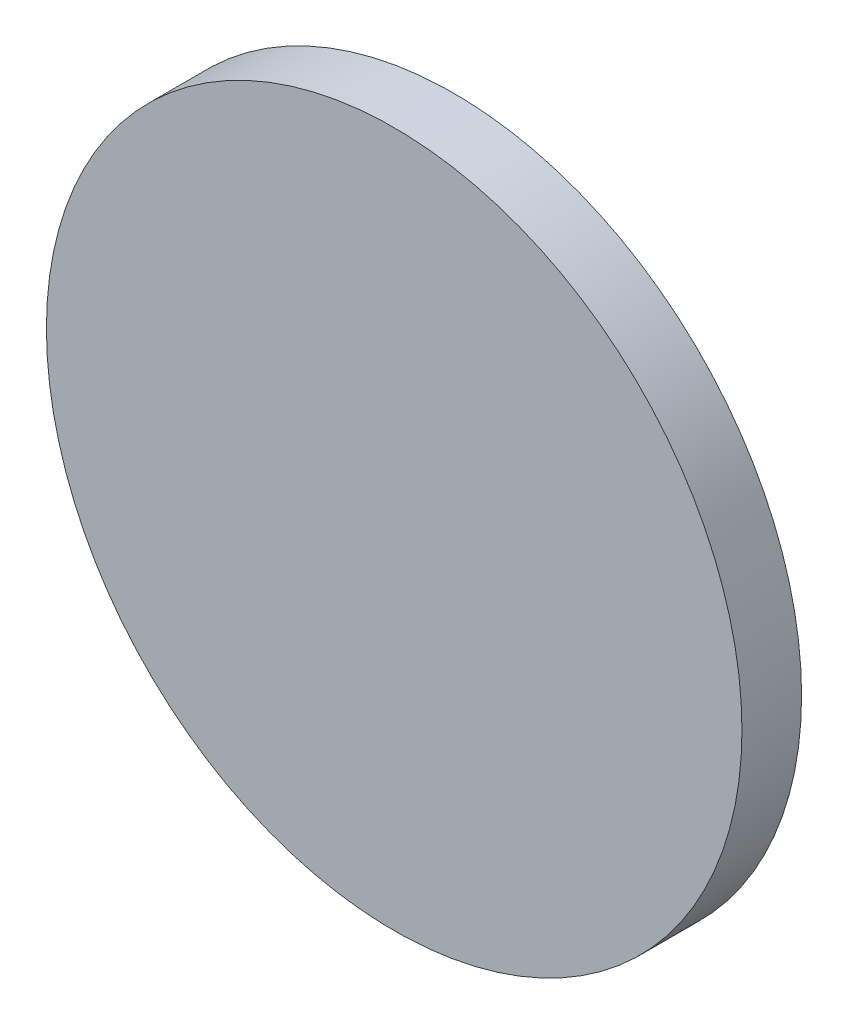
ISO-10303-21;
HEADER;
FILE_DESCRIPTION(('STEP AP214'),'2;1');
FILE_NAME('part.step','',(''),(''),'','','');
FILE_SCHEMA(('AUTOMOTIVE_DESIGN { 1 0 10303 214 1 1 1 1 }'));
ENDSEC;
DATA;
#1=APPLICATION_CONTEXT('core data for automotive mechanical design processes');
#2=APPLICATION_PROTOCOL_DEFINITION('international standard','automotive_design',2000,#1);
#3=PRODUCT_CONTEXT('',#1,'mechanical');
#4=PRODUCT('Part','Part','',(#3));
#5=PRODUCT_RELATED_PRODUCT_CATEGORY('part','',(#4));
#6=PRODUCT_DEFINITION_FORMATION('','',#4);
#7=PRODUCT_DEFINITION_CONTEXT('part definition',#1,'design');
#8=PRODUCT_DEFINITION('design','',#6,#7);
#9=PRODUCT_DEFINITION_SHAPE('','',#8);
#10=(LENGTH_UNIT() NAMED_UNIT(*) SI_UNIT(.MILLI.,.METRE.));
#11=(NAMED_UNIT(*) PLANE_ANGLE_UNIT() SI_UNIT($,.RADIAN.));
#12=(NAMED_UNIT(*) SI_UNIT($,.STERADIAN.) SOLID_ANGLE_UNIT());
#13=UNCERTAINTY_MEASURE_WITH_UNIT(LENGTH_MEASURE(1.E-05),#10,'distance_accuracy_value','');
#14=(GEOMETRIC_REPRESENTATION_CONTEXT(3) GLOBAL_UNCERTAINTY_ASSIGNED_CONTEXT((#13)) GLOBAL_UNIT_ASSIGNED_CONTEXT((#10,
#11,#12)) REPRESENTATION_CONTEXT('',''));
#15=CARTESIAN_POINT('',(0.,0.,0.));
#16=DIRECTION('',(0.,0.,1.));
#17=DIRECTION('',(1.,0.,0.));
#18=AXIS2_PLACEMENT_3D('',#15,#16,#17);
#19=CARTESIAN_POINT('',(3.8481,4.597400006176,0.03429));
#20=DIRECTION('',(0.,0.,1.));
#21=DIRECTION('',(1.,0.,0.));
#22=AXIS2_PLACEMENT_3D('',#19,#20,#21);
#23=PLANE('',#22);
#24=CARTESIAN_POINT('',(3.8481,4.597400006176,0.03429));
#25=DIRECTION('',(0.,0.,1.));
#26=DIRECTION('',(1.,0.,0.));
#27=AXIS2_PLACEMENT_3D('',#24,#25,#26);
#28=CIRCLE('',#27,0.200024667);
#29=CARTESIAN_POINT('',(4.048124667,4.597400006176,0.03429));
#30=VERTEX_POINT('',#29);
#31=EDGE_CURVE('E18',#30,#30,#28,.F.);
#32=ORIENTED_EDGE('',*,*,#31,.F.);
#33=EDGE_LOOP('',(#32));
#34=FACE_BOUND('',#33,.T.);
#35=ADVANCED_FACE('F15',(#34),#23,.T.);
#36=CARTESIAN_POINT('',(3.8481,4.597400006176,0.));
#37=DIRECTION('',(0.,0.,1.));
#38=DIRECTION('',(1.,0.,0.));
#39=AXIS2_PLACEMENT_3D('',#36,#37,#38);
#40=CYLINDRICAL_SURFACE('',#39,0.200024667);
#41=ORIENTED_EDGE('',*,*,#31,.T.);
#42=EDGE_LOOP('',(#41));
#43=FACE_BOUND('',#42,.T.);
#44=CARTESIAN_POINT('',(3.8481,4.597400006176,0.));
#45=DIRECTION('',(0.,0.,1.));
#46=DIRECTION('',(1.,0.,0.));
#47=AXIS2_PLACEMENT_3D('',#44,#45,#46);
#48=CIRCLE('',#47,0.200024667);
#49=CARTESIAN_POINT('',(4.048124667,4.597400006176,0.));
#50=VERTEX_POINT('',#49);
#51=EDGE_CURVE('E10',#50,#50,#48,.F.);
#52=ORIENTED_EDGE('',*,*,#51,.F.);
#53=EDGE_LOOP('',(#52));
#54=FACE_BOUND('',#53,.T.);
#55=ADVANCED_FACE('F27',(#43,#54),#40,.T.);
#56=CARTESIAN_POINT('',(3.8481,4.597400006176,0.));
#57=DIRECTION('',(0.,0.,-1.));
#58=DIRECTION('',(-1.,0.,0.));
#59=AXIS2_PLACEMENT_3D('',#56,#57,#58);
#60=PLANE('',#59);
#61=ORIENTED_EDGE('',*,*,#51,.T.);
#62=EDGE_LOOP('',(#61));
#63=FACE_BOUND('',#62,.T.);
#64=ADVANCED_FACE('F35',(#63),#60,.T.);
#65=CLOSED_SHELL('',(#35,#55,#64));
#66=MANIFOLD_SOLID_BREP('B1',#65);
#67=ADVANCED_BREP_SHAPE_REPRESENTATION('',(#18,#66),#14);
#68=SHAPE_DEFINITION_REPRESENTATION(#9,#67);
ENDSEC;
END-ISO-10303-21;
